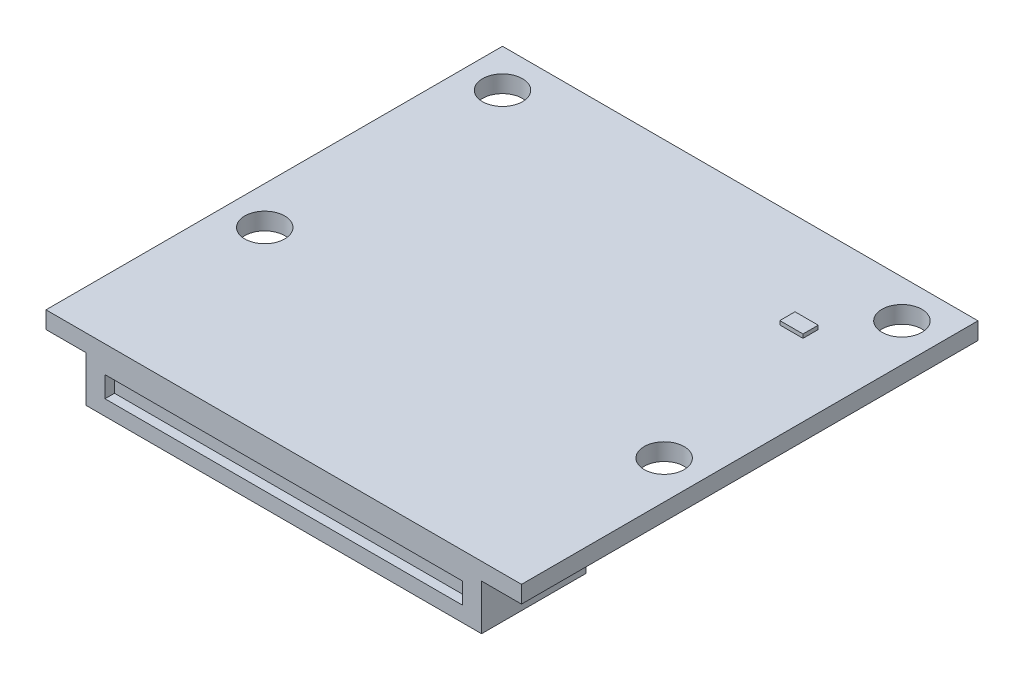
ISO-10303-21;
HEADER;
FILE_DESCRIPTION(('STEP AP214'),'2;1');
FILE_NAME('part.step','',(''),(''),'','','');
FILE_SCHEMA(('AUTOMOTIVE_DESIGN { 1 0 10303 214 1 1 1 1 }'));
ENDSEC;
DATA;
#1=APPLICATION_CONTEXT('core data for automotive mechanical design processes');
#2=APPLICATION_PROTOCOL_DEFINITION('international standard','automotive_design',2000,#1);
#3=PRODUCT_CONTEXT('',#1,'mechanical');
#4=PRODUCT('Part','Part','',(#3));
#5=PRODUCT_RELATED_PRODUCT_CATEGORY('part','',(#4));
#6=PRODUCT_DEFINITION_FORMATION('','',#4);
#7=PRODUCT_DEFINITION_CONTEXT('part definition',#1,'design');
#8=PRODUCT_DEFINITION('design','',#6,#7);
#9=PRODUCT_DEFINITION_SHAPE('','',#8);
#10=(LENGTH_UNIT() NAMED_UNIT(*) SI_UNIT(.MILLI.,.METRE.));
#11=(NAMED_UNIT(*) PLANE_ANGLE_UNIT() SI_UNIT($,.RADIAN.));
#12=(NAMED_UNIT(*) SI_UNIT($,.STERADIAN.) SOLID_ANGLE_UNIT());
#13=UNCERTAINTY_MEASURE_WITH_UNIT(LENGTH_MEASURE(1.E-05),#10,'distance_accuracy_value','');
#14=(GEOMETRIC_REPRESENTATION_CONTEXT(3) GLOBAL_UNCERTAINTY_ASSIGNED_CONTEXT((#13)) GLOBAL_UNIT_ASSIGNED_CONTEXT((#10,
#11,#12)) REPRESENTATION_CONTEXT('',''));
#15=CARTESIAN_POINT('',(0.,0.,0.));
#16=DIRECTION('',(0.,0.,1.));
#17=DIRECTION('',(1.,0.,0.));
#18=AXIS2_PLACEMENT_3D('',#15,#16,#17);
#19=CARTESIAN_POINT('',(0.,0.,0.));
#20=DIRECTION('',(0.,1.,0.));
#21=DIRECTION('',(0.,0.,1.));
#22=AXIS2_PLACEMENT_3D('',#19,#20,#21);
#23=PLANE('',#22);
#24=DIRECTION('',(0.,0.,1.));
#25=VECTOR('',#24,1.);
#26=CARTESIAN_POINT('',(-12.5,0.,-14.5));
#27=LINE('',#26,#25);
#28=CARTESIAN_POINT('',(-12.5,0.,-14.5));
#29=VERTEX_POINT('',#28);
#30=CARTESIAN_POINT('',(-12.5,0.,9.5));
#31=VERTEX_POINT('',#30);
#32=EDGE_CURVE('E274',#29,#31,#27,.T.);
#33=ORIENTED_EDGE('',*,*,#32,.T.);
#34=DIRECTION('',(1.,0.,0.));
#35=VECTOR('',#34,1.);
#36=CARTESIAN_POINT('',(-12.5,0.,9.5));
#37=LINE('',#36,#35);
#38=CARTESIAN_POINT('',(12.5,0.,9.5));
#39=VERTEX_POINT('',#38);
#40=EDGE_CURVE('E277',#31,#39,#37,.T.);
#41=ORIENTED_EDGE('',*,*,#40,.T.);
#42=DIRECTION('',(0.,0.,-1.));
#43=VECTOR('',#42,1.);
#44=CARTESIAN_POINT('',(12.5,0.,-14.5));
#45=LINE('',#44,#43);
#46=CARTESIAN_POINT('',(12.5,0.,-14.5));
#47=VERTEX_POINT('',#46);
#48=EDGE_CURVE('E281',#39,#47,#45,.T.);
#49=ORIENTED_EDGE('',*,*,#48,.T.);
#50=DIRECTION('',(-1.,0.,0.));
#51=VECTOR('',#50,1.);
#52=CARTESIAN_POINT('',(-12.5,0.,-14.5));
#53=LINE('',#52,#51);
#54=EDGE_CURVE('E284',#47,#29,#53,.T.);
#55=ORIENTED_EDGE('',*,*,#54,.T.);
#56=EDGE_LOOP('',(#33,#41,#49,#55));
#57=FACE_BOUND('',#56,.T.);
#58=CARTESIAN_POINT('',(10.5,0.,-12.5));
#59=DIRECTION('',(0.,1.,0.));
#60=DIRECTION('',(0.,0.,1.));
#61=AXIS2_PLACEMENT_3D('',#58,#59,#60);
#62=CIRCLE('',#61,1.05);
#63=CARTESIAN_POINT('',(10.5,0.,-11.45));
#64=VERTEX_POINT('',#63);
#65=EDGE_CURVE('E336',#64,#64,#62,.T.);
#66=ORIENTED_EDGE('',*,*,#65,.F.);
#67=EDGE_LOOP('',(#66));
#68=FACE_BOUND('',#67,.T.);
#69=CARTESIAN_POINT('',(10.5,0.,0.));
#70=DIRECTION('',(0.,1.,0.));
#71=DIRECTION('',(0.,0.,1.));
#72=AXIS2_PLACEMENT_3D('',#69,#70,#71);
#73=CIRCLE('',#72,1.05);
#74=CARTESIAN_POINT('',(10.5,0.,1.05));
#75=VERTEX_POINT('',#74);
#76=EDGE_CURVE('E330',#75,#75,#73,.T.);
#77=ORIENTED_EDGE('',*,*,#76,.F.);
#78=EDGE_LOOP('',(#77));
#79=FACE_BOUND('',#78,.T.);
#80=CARTESIAN_POINT('',(-10.5,0.,0.));
#81=DIRECTION('',(0.,1.,0.));
#82=DIRECTION('',(0.,0.,-1.));
#83=AXIS2_PLACEMENT_3D('',#80,#81,#82);
#84=CIRCLE('',#83,1.05);
#85=CARTESIAN_POINT('',(-10.5,0.,-1.05));
#86=VERTEX_POINT('',#85);
#87=EDGE_CURVE('E325',#86,#86,#84,.T.);
#88=ORIENTED_EDGE('',*,*,#87,.F.);
#89=EDGE_LOOP('',(#88));
#90=FACE_BOUND('',#89,.T.);
#91=CARTESIAN_POINT('',(-10.5,0.,-12.5));
#92=DIRECTION('',(0.,1.,0.));
#93=DIRECTION('',(0.,0.,-1.));
#94=AXIS2_PLACEMENT_3D('',#91,#92,#93);
#95=CIRCLE('',#94,1.05);
#96=CARTESIAN_POINT('',(-10.5,0.,-13.55));
#97=VERTEX_POINT('',#96);
#98=EDGE_CURVE('E319',#97,#97,#95,.T.);
#99=ORIENTED_EDGE('',*,*,#98,.F.);
#100=EDGE_LOOP('',(#99));
#101=FACE_BOUND('',#100,.T.);
#102=DIRECTION('',(-1.,0.,0.));
#103=VECTOR('',#102,1.);
#104=CARTESIAN_POINT('',(8.7,0.,-9.9));
#105=LINE('',#104,#103);
#106=CARTESIAN_POINT('',(8.7,0.,-9.9));
#107=VERTEX_POINT('',#106);
#108=CARTESIAN_POINT('',(7.48,0.,-9.9));
#109=VERTEX_POINT('',#108);
#110=EDGE_CURVE('E203',#107,#109,#105,.T.);
#111=ORIENTED_EDGE('',*,*,#110,.F.);
#112=DIRECTION('',(0.,0.,-1.));
#113=VECTOR('',#112,1.);
#114=CARTESIAN_POINT('',(8.7,0.,-9.1));
#115=LINE('',#114,#113);
#116=CARTESIAN_POINT('',(8.7,0.,-9.1));
#117=VERTEX_POINT('',#116);
#118=EDGE_CURVE('E186',#117,#107,#115,.T.);
#119=ORIENTED_EDGE('',*,*,#118,.F.);
#120=DIRECTION('',(1.,0.,0.));
#121=VECTOR('',#120,1.);
#122=CARTESIAN_POINT('',(8.7,0.,-9.1));
#123=LINE('',#122,#121);
#124=CARTESIAN_POINT('',(7.48,0.,-9.1));
#125=VERTEX_POINT('',#124);
#126=EDGE_CURVE('E194',#125,#117,#123,.T.);
#127=ORIENTED_EDGE('',*,*,#126,.F.);
#128=DIRECTION('',(0.,0.,1.));
#129=VECTOR('',#128,1.);
#130=CARTESIAN_POINT('',(7.48,0.,-9.1));
#131=LINE('',#130,#129);
#132=EDGE_CURVE('E205',#109,#125,#131,.T.);
#133=ORIENTED_EDGE('',*,*,#132,.F.);
#134=EDGE_LOOP('',(#111,#119,#127,#133));
#135=FACE_BOUND('',#134,.T.);
#136=ADVANCED_FACE('F36',(#57,#68,#79,#90,#101,#135),#23,.T.);
#137=CARTESIAN_POINT('',(0.,-0.9,0.));
#138=DIRECTION('',(0.,1.,0.));
#139=DIRECTION('',(0.,0.,1.));
#140=AXIS2_PLACEMENT_3D('',#137,#138,#139);
#141=PLANE('',#140);
#142=CARTESIAN_POINT('',(10.5,-0.9,-12.5));
#143=DIRECTION('',(0.,1.,0.));
#144=DIRECTION('',(0.,0.,1.));
#145=AXIS2_PLACEMENT_3D('',#142,#143,#144);
#146=CIRCLE('',#145,1.05);
#147=CARTESIAN_POINT('',(10.5,-0.9,-11.45));
#148=VERTEX_POINT('',#147);
#149=EDGE_CURVE('E278',#148,#148,#146,.T.);
#150=ORIENTED_EDGE('',*,*,#149,.T.);
#151=EDGE_LOOP('',(#150));
#152=FACE_BOUND('',#151,.T.);
#153=CARTESIAN_POINT('',(10.5,-0.9,0.));
#154=DIRECTION('',(0.,1.,0.));
#155=DIRECTION('',(0.,0.,1.));
#156=AXIS2_PLACEMENT_3D('',#153,#154,#155);
#157=CIRCLE('',#156,1.05);
#158=CARTESIAN_POINT('',(10.5,-0.9,1.05));
#159=VERTEX_POINT('',#158);
#160=EDGE_CURVE('E333',#159,#159,#157,.T.);
#161=ORIENTED_EDGE('',*,*,#160,.T.);
#162=EDGE_LOOP('',(#161));
#163=FACE_BOUND('',#162,.T.);
#164=CARTESIAN_POINT('',(-10.5,-0.9,0.));
#165=DIRECTION('',(0.,1.,0.));
#166=DIRECTION('',(0.,0.,-1.));
#167=AXIS2_PLACEMENT_3D('',#164,#165,#166);
#168=CIRCLE('',#167,1.05);
#169=CARTESIAN_POINT('',(-10.5,-0.9,-1.05));
#170=VERTEX_POINT('',#169);
#171=EDGE_CURVE('E327',#170,#170,#168,.T.);
#172=ORIENTED_EDGE('',*,*,#171,.T.);
#173=EDGE_LOOP('',(#172));
#174=FACE_BOUND('',#173,.T.);
#175=CARTESIAN_POINT('',(-10.5,-0.9,-12.5));
#176=DIRECTION('',(0.,1.,0.));
#177=DIRECTION('',(0.,0.,-1.));
#178=AXIS2_PLACEMENT_3D('',#175,#176,#177);
#179=CIRCLE('',#178,1.05);
#180=CARTESIAN_POINT('',(-10.5,-0.9,-13.55));
#181=VERTEX_POINT('',#180);
#182=EDGE_CURVE('E321',#181,#181,#179,.T.);
#183=ORIENTED_EDGE('',*,*,#182,.T.);
#184=EDGE_LOOP('',(#183));
#185=FACE_BOUND('',#184,.T.);
#186=DIRECTION('',(0.,0.,-1.));
#187=VECTOR('',#186,1.);
#188=CARTESIAN_POINT('',(-10.4,-0.9,9.5));
#189=LINE('',#188,#187);
#190=CARTESIAN_POINT('',(-10.4,-0.9,9.5));
#191=VERTEX_POINT('',#190);
#192=CARTESIAN_POINT('',(-10.4,-0.9,4.));
#193=VERTEX_POINT('',#192);
#194=EDGE_CURVE('E216',#191,#193,#189,.T.);
#195=ORIENTED_EDGE('',*,*,#194,.F.);
#196=DIRECTION('',(1.,0.,0.));
#197=VECTOR('',#196,1.);
#198=CARTESIAN_POINT('',(-12.5,-0.9,9.5));
#199=LINE('',#198,#197);
#200=CARTESIAN_POINT('',(-12.5,-0.9,9.5));
#201=VERTEX_POINT('',#200);
#202=EDGE_CURVE('E259',#201,#191,#199,.T.);
#203=ORIENTED_EDGE('',*,*,#202,.F.);
#204=DIRECTION('',(0.,0.,1.));
#205=VECTOR('',#204,1.);
#206=CARTESIAN_POINT('',(-12.5,-0.9,-14.5));
#207=LINE('',#206,#205);
#208=CARTESIAN_POINT('',(-12.5,-0.9,-14.5));
#209=VERTEX_POINT('',#208);
#210=EDGE_CURVE('E260',#209,#201,#207,.T.);
#211=ORIENTED_EDGE('',*,*,#210,.F.);
#212=DIRECTION('',(-1.,0.,0.));
#213=VECTOR('',#212,1.);
#214=CARTESIAN_POINT('',(-12.5,-0.9,-14.5));
#215=LINE('',#214,#213);
#216=CARTESIAN_POINT('',(12.5,-0.9,-14.5));
#217=VERTEX_POINT('',#216);
#218=EDGE_CURVE('E270',#217,#209,#215,.T.);
#219=ORIENTED_EDGE('',*,*,#218,.F.);
#220=DIRECTION('',(0.,0.,-1.));
#221=VECTOR('',#220,1.);
#222=CARTESIAN_POINT('',(12.5,-0.9,-14.5));
#223=LINE('',#222,#221);
#224=CARTESIAN_POINT('',(12.5,-0.9,9.5));
#225=VERTEX_POINT('',#224);
#226=EDGE_CURVE('E266',#225,#217,#223,.T.);
#227=ORIENTED_EDGE('',*,*,#226,.F.);
#228=CARTESIAN_POINT('',(10.4,-0.9,9.5));
#229=VERTEX_POINT('',#228);
#230=EDGE_CURVE('E256',#229,#225,#199,.T.);
#231=ORIENTED_EDGE('',*,*,#230,.F.);
#232=DIRECTION('',(0.,0.,1.));
#233=VECTOR('',#232,1.);
#234=CARTESIAN_POINT('',(10.4,-0.9,9.5));
#235=LINE('',#234,#233);
#236=CARTESIAN_POINT('',(10.4,-0.9,4.));
#237=VERTEX_POINT('',#236);
#238=EDGE_CURVE('E221',#237,#229,#235,.T.);
#239=ORIENTED_EDGE('',*,*,#238,.F.);
#240=DIRECTION('',(1.,0.,0.));
#241=VECTOR('',#240,1.);
#242=CARTESIAN_POINT('',(-10.4,-0.9,4.));
#243=LINE('',#242,#241);
#244=EDGE_CURVE('E228',#193,#237,#243,.T.);
#245=ORIENTED_EDGE('',*,*,#244,.F.);
#246=EDGE_LOOP('',(#195,#203,#211,#219,#227,#231,#239,#245));
#247=FACE_BOUND('',#246,.T.);
#248=ADVANCED_FACE('F306',(#152,#163,#174,#185,#247),#141,.F.);
#249=CARTESIAN_POINT('',(-12.5,-0.9,-14.5));
#250=DIRECTION('',(-1.,0.,0.));
#251=DIRECTION('',(0.,0.,1.));
#252=AXIS2_PLACEMENT_3D('',#249,#250,#251);
#253=PLANE('',#252);
#254=ORIENTED_EDGE('',*,*,#32,.F.);
#255=DIRECTION('',(0.,1.,0.));
#256=VECTOR('',#255,1.);
#257=CARTESIAN_POINT('',(-12.5,-0.9,-14.5));
#258=LINE('',#257,#256);
#259=EDGE_CURVE('E11',#209,#29,#258,.T.);
#260=ORIENTED_EDGE('',*,*,#259,.F.);
#261=ORIENTED_EDGE('',*,*,#210,.T.);
#262=DIRECTION('',(0.,1.,0.));
#263=VECTOR('',#262,1.);
#264=CARTESIAN_POINT('',(-12.5,-0.9,9.5));
#265=LINE('',#264,#263);
#266=EDGE_CURVE('E273',#201,#31,#265,.T.);
#267=ORIENTED_EDGE('',*,*,#266,.T.);
#268=EDGE_LOOP('',(#254,#260,#261,#267));
#269=FACE_BOUND('',#268,.T.);
#270=ADVANCED_FACE('F38',(#269),#253,.T.);
#271=CARTESIAN_POINT('',(-12.5,-0.9,-14.5));
#272=DIRECTION('',(0.,0.,-1.));
#273=DIRECTION('',(-1.,0.,0.));
#274=AXIS2_PLACEMENT_3D('',#271,#272,#273);
#275=PLANE('',#274);
#276=ORIENTED_EDGE('',*,*,#54,.F.);
#277=DIRECTION('',(0.,1.,0.));
#278=VECTOR('',#277,1.);
#279=CARTESIAN_POINT('',(12.5,-0.9,-14.5));
#280=LINE('',#279,#278);
#281=EDGE_CURVE('E45',#217,#47,#280,.T.);
#282=ORIENTED_EDGE('',*,*,#281,.F.);
#283=ORIENTED_EDGE('',*,*,#218,.T.);
#284=ORIENTED_EDGE('',*,*,#259,.T.);
#285=EDGE_LOOP('',(#276,#282,#283,#284));
#286=FACE_BOUND('',#285,.T.);
#287=ADVANCED_FACE('F303',(#286),#275,.T.);
#288=CARTESIAN_POINT('',(12.5,-0.9,-14.5));
#289=DIRECTION('',(1.,0.,0.));
#290=DIRECTION('',(0.,0.,-1.));
#291=AXIS2_PLACEMENT_3D('',#288,#289,#290);
#292=PLANE('',#291);
#293=ORIENTED_EDGE('',*,*,#48,.F.);
#294=DIRECTION('',(0.,1.,0.));
#295=VECTOR('',#294,1.);
#296=CARTESIAN_POINT('',(12.5,-0.9,9.5));
#297=LINE('',#296,#295);
#298=EDGE_CURVE('E288',#225,#39,#297,.T.);
#299=ORIENTED_EDGE('',*,*,#298,.F.);
#300=ORIENTED_EDGE('',*,*,#226,.T.);
#301=ORIENTED_EDGE('',*,*,#281,.T.);
#302=EDGE_LOOP('',(#293,#299,#300,#301));
#303=FACE_BOUND('',#302,.T.);
#304=ADVANCED_FACE('F413',(#303),#292,.T.);
#305=CARTESIAN_POINT('',(-12.5,-0.9,9.5));
#306=DIRECTION('',(0.,0.,1.));
#307=DIRECTION('',(1.,0.,0.));
#308=AXIS2_PLACEMENT_3D('',#305,#306,#307);
#309=PLANE('',#308);
#310=DIRECTION('',(0.,-1.,0.));
#311=VECTOR('',#310,1.);
#312=CARTESIAN_POINT('',(-9.4,-1.4,9.5));
#313=LINE('',#312,#311);
#314=CARTESIAN_POINT('',(-9.4,-1.4,9.5));
#315=VERTEX_POINT('',#314);
#316=CARTESIAN_POINT('',(-9.4,-2.5,9.5));
#317=VERTEX_POINT('',#316);
#318=EDGE_CURVE('E53',#315,#317,#313,.T.);
#319=ORIENTED_EDGE('',*,*,#318,.F.);
#320=DIRECTION('',(-1.,0.,0.));
#321=VECTOR('',#320,1.);
#322=CARTESIAN_POINT('',(-9.4,-1.4,9.5));
#323=LINE('',#322,#321);
#324=CARTESIAN_POINT('',(9.4,-1.4,9.5));
#325=VERTEX_POINT('',#324);
#326=EDGE_CURVE('E171',#325,#315,#323,.T.);
#327=ORIENTED_EDGE('',*,*,#326,.F.);
#328=DIRECTION('',(0.,1.,0.));
#329=VECTOR('',#328,1.);
#330=CARTESIAN_POINT('',(9.4,-1.4,9.5));
#331=LINE('',#330,#329);
#332=CARTESIAN_POINT('',(9.4,-2.5,9.5));
#333=VERTEX_POINT('',#332);
#334=EDGE_CURVE('E174',#333,#325,#331,.T.);
#335=ORIENTED_EDGE('',*,*,#334,.F.);
#336=DIRECTION('',(1.,0.,0.));
#337=VECTOR('',#336,1.);
#338=CARTESIAN_POINT('',(-9.4,-2.5,9.5));
#339=LINE('',#338,#337);
#340=EDGE_CURVE('E180',#317,#333,#339,.T.);
#341=ORIENTED_EDGE('',*,*,#340,.F.);
#342=EDGE_LOOP('',(#319,#327,#335,#341));
#343=FACE_BOUND('',#342,.T.);
#344=ORIENTED_EDGE('',*,*,#40,.F.);
#345=ORIENTED_EDGE('',*,*,#266,.F.);
#346=ORIENTED_EDGE('',*,*,#202,.T.);
#347=DIRECTION('',(0.,1.,0.));
#348=VECTOR('',#347,1.);
#349=CARTESIAN_POINT('',(-10.4,-3.3,9.5));
#350=LINE('',#349,#348);
#351=CARTESIAN_POINT('',(-10.4,-3.3,9.5));
#352=VERTEX_POINT('',#351);
#353=EDGE_CURVE('E227',#352,#191,#350,.T.);
#354=ORIENTED_EDGE('',*,*,#353,.F.);
#355=DIRECTION('',(-1.,0.,0.));
#356=VECTOR('',#355,1.);
#357=CARTESIAN_POINT('',(-10.4,-3.3,9.5));
#358=LINE('',#357,#356);
#359=CARTESIAN_POINT('',(10.4,-3.3,9.5));
#360=VERTEX_POINT('',#359);
#361=EDGE_CURVE('E225',#360,#352,#358,.T.);
#362=ORIENTED_EDGE('',*,*,#361,.F.);
#363=DIRECTION('',(0.,1.,0.));
#364=VECTOR('',#363,1.);
#365=CARTESIAN_POINT('',(10.4,-3.3,9.5));
#366=LINE('',#365,#364);
#367=EDGE_CURVE('E240',#360,#229,#366,.T.);
#368=ORIENTED_EDGE('',*,*,#367,.T.);
#369=ORIENTED_EDGE('',*,*,#230,.T.);
#370=ORIENTED_EDGE('',*,*,#298,.T.);
#371=EDGE_LOOP('',(#344,#345,#346,#354,#362,#368,#369,#370));
#372=FACE_BOUND('',#371,.T.);
#373=ADVANCED_FACE('F296',(#343,#372),#309,.T.);
#374=CARTESIAN_POINT('',(10.5,-0.9,-12.5));
#375=DIRECTION('',(0.,1.,0.));
#376=DIRECTION('',(0.,0.,1.));
#377=AXIS2_PLACEMENT_3D('',#374,#375,#376);
#378=CYLINDRICAL_SURFACE('',#377,1.05);
#379=ORIENTED_EDGE('',*,*,#149,.F.);
#380=EDGE_LOOP('',(#379));
#381=FACE_BOUND('',#380,.T.);
#382=ORIENTED_EDGE('',*,*,#65,.T.);
#383=EDGE_LOOP('',(#382));
#384=FACE_BOUND('',#383,.T.);
#385=ADVANCED_FACE('F343',(#381,#384),#378,.F.);
#386=CARTESIAN_POINT('',(10.5,-0.9,0.));
#387=DIRECTION('',(0.,1.,0.));
#388=DIRECTION('',(0.,0.,1.));
#389=AXIS2_PLACEMENT_3D('',#386,#387,#388);
#390=CYLINDRICAL_SURFACE('',#389,1.05);
#391=ORIENTED_EDGE('',*,*,#160,.F.);
#392=EDGE_LOOP('',(#391));
#393=FACE_BOUND('',#392,.T.);
#394=ORIENTED_EDGE('',*,*,#76,.T.);
#395=EDGE_LOOP('',(#394));
#396=FACE_BOUND('',#395,.T.);
#397=ADVANCED_FACE('F400',(#393,#396),#390,.F.);
#398=CARTESIAN_POINT('',(-10.5,-0.9,0.));
#399=DIRECTION('',(0.,1.,0.));
#400=DIRECTION('',(0.,0.,1.));
#401=AXIS2_PLACEMENT_3D('',#398,#399,#400);
#402=CYLINDRICAL_SURFACE('',#401,1.05);
#403=ORIENTED_EDGE('',*,*,#171,.F.);
#404=EDGE_LOOP('',(#403));
#405=FACE_BOUND('',#404,.T.);
#406=ORIENTED_EDGE('',*,*,#87,.T.);
#407=EDGE_LOOP('',(#406));
#408=FACE_BOUND('',#407,.T.);
#409=ADVANCED_FACE('F396',(#405,#408),#402,.F.);
#410=CARTESIAN_POINT('',(-10.5,-0.9,-12.5));
#411=DIRECTION('',(0.,1.,0.));
#412=DIRECTION('',(0.,0.,1.));
#413=AXIS2_PLACEMENT_3D('',#410,#411,#412);
#414=CYLINDRICAL_SURFACE('',#413,1.05);
#415=ORIENTED_EDGE('',*,*,#182,.F.);
#416=EDGE_LOOP('',(#415));
#417=FACE_BOUND('',#416,.T.);
#418=ORIENTED_EDGE('',*,*,#98,.T.);
#419=EDGE_LOOP('',(#418));
#420=FACE_BOUND('',#419,.T.);
#421=ADVANCED_FACE('F393',(#417,#420),#414,.F.);
#422=CARTESIAN_POINT('',(-10.4,-3.3,9.5));
#423=DIRECTION('',(1.,0.,0.));
#424=DIRECTION('',(0.,0.,-1.));
#425=AXIS2_PLACEMENT_3D('',#422,#423,#424);
#426=PLANE('',#425);
#427=ORIENTED_EDGE('',*,*,#194,.T.);
#428=DIRECTION('',(0.,1.,0.));
#429=VECTOR('',#428,1.);
#430=CARTESIAN_POINT('',(-10.4,-3.3,4.));
#431=LINE('',#430,#429);
#432=CARTESIAN_POINT('',(-10.4,-3.3,4.));
#433=VERTEX_POINT('',#432);
#434=EDGE_CURVE('E246',#433,#193,#431,.T.);
#435=ORIENTED_EDGE('',*,*,#434,.F.);
#436=DIRECTION('',(0.,0.,-1.));
#437=VECTOR('',#436,1.);
#438=CARTESIAN_POINT('',(-10.4,-3.3,9.5));
#439=LINE('',#438,#437);
#440=EDGE_CURVE('E217',#352,#433,#439,.T.);
#441=ORIENTED_EDGE('',*,*,#440,.F.);
#442=ORIENTED_EDGE('',*,*,#353,.T.);
#443=EDGE_LOOP('',(#427,#435,#441,#442));
#444=FACE_BOUND('',#443,.T.);
#445=ADVANCED_FACE('F309',(#444),#426,.F.);
#446=CARTESIAN_POINT('',(-10.4,-3.3,4.));
#447=DIRECTION('',(0.,0.,1.));
#448=DIRECTION('',(1.,0.,0.));
#449=AXIS2_PLACEMENT_3D('',#446,#447,#448);
#450=PLANE('',#449);
#451=ORIENTED_EDGE('',*,*,#244,.T.);
#452=DIRECTION('',(0.,1.,0.));
#453=VECTOR('',#452,1.);
#454=CARTESIAN_POINT('',(10.4,-3.3,4.));
#455=LINE('',#454,#453);
#456=CARTESIAN_POINT('',(10.4,-3.3,4.));
#457=VERTEX_POINT('',#456);
#458=EDGE_CURVE('E233',#457,#237,#455,.T.);
#459=ORIENTED_EDGE('',*,*,#458,.F.);
#460=DIRECTION('',(1.,0.,0.));
#461=VECTOR('',#460,1.);
#462=CARTESIAN_POINT('',(-10.4,-3.3,4.));
#463=LINE('',#462,#461);
#464=EDGE_CURVE('E220',#433,#457,#463,.T.);
#465=ORIENTED_EDGE('',*,*,#464,.F.);
#466=ORIENTED_EDGE('',*,*,#434,.T.);
#467=EDGE_LOOP('',(#451,#459,#465,#466));
#468=FACE_BOUND('',#467,.T.);
#469=ADVANCED_FACE('F318',(#468),#450,.F.);
#470=CARTESIAN_POINT('',(10.4,-3.3,9.5));
#471=DIRECTION('',(-1.,0.,0.));
#472=DIRECTION('',(0.,0.,1.));
#473=AXIS2_PLACEMENT_3D('',#470,#471,#472);
#474=PLANE('',#473);
#475=ORIENTED_EDGE('',*,*,#238,.T.);
#476=ORIENTED_EDGE('',*,*,#367,.F.);
#477=DIRECTION('',(0.,0.,1.));
#478=VECTOR('',#477,1.);
#479=CARTESIAN_POINT('',(10.4,-3.3,9.5));
#480=LINE('',#479,#478);
#481=EDGE_CURVE('E223',#457,#360,#480,.T.);
#482=ORIENTED_EDGE('',*,*,#481,.F.);
#483=ORIENTED_EDGE('',*,*,#458,.T.);
#484=EDGE_LOOP('',(#475,#476,#482,#483));
#485=FACE_BOUND('',#484,.T.);
#486=ADVANCED_FACE('F316',(#485),#474,.F.);
#487=CARTESIAN_POINT('',(0.,-3.3,0.));
#488=DIRECTION('',(0.,-1.,0.));
#489=DIRECTION('',(0.,0.,-1.));
#490=AXIS2_PLACEMENT_3D('',#487,#488,#489);
#491=PLANE('',#490);
#492=ORIENTED_EDGE('',*,*,#440,.T.);
#493=ORIENTED_EDGE('',*,*,#464,.T.);
#494=ORIENTED_EDGE('',*,*,#481,.T.);
#495=ORIENTED_EDGE('',*,*,#361,.T.);
#496=EDGE_LOOP('',(#492,#493,#494,#495));
#497=FACE_BOUND('',#496,.T.);
#498=ADVANCED_FACE('F312',(#497),#491,.T.);
#499=CARTESIAN_POINT('',(8.7,0.2,-9.1));
#500=DIRECTION('',(-1.,0.,0.));
#501=DIRECTION('',(0.,0.,1.));
#502=AXIS2_PLACEMENT_3D('',#499,#500,#501);
#503=PLANE('',#502);
#504=ORIENTED_EDGE('',*,*,#118,.T.);
#505=DIRECTION('',(0.,-1.,0.));
#506=VECTOR('',#505,1.);
#507=CARTESIAN_POINT('',(8.7,0.2,-9.9));
#508=LINE('',#507,#506);
#509=CARTESIAN_POINT('',(8.7,0.2,-9.9));
#510=VERTEX_POINT('',#509);
#511=EDGE_CURVE('E214',#510,#107,#508,.T.);
#512=ORIENTED_EDGE('',*,*,#511,.F.);
#513=DIRECTION('',(0.,0.,-1.));
#514=VECTOR('',#513,1.);
#515=CARTESIAN_POINT('',(8.7,0.2,-9.1));
#516=LINE('',#515,#514);
#517=CARTESIAN_POINT('',(8.7,0.2,-9.1));
#518=VERTEX_POINT('',#517);
#519=EDGE_CURVE('E190',#518,#510,#516,.T.);
#520=ORIENTED_EDGE('',*,*,#519,.F.);
#521=DIRECTION('',(0.,-1.,0.));
#522=VECTOR('',#521,1.);
#523=CARTESIAN_POINT('',(8.7,0.2,-9.1));
#524=LINE('',#523,#522);
#525=EDGE_CURVE('E200',#518,#117,#524,.T.);
#526=ORIENTED_EDGE('',*,*,#525,.T.);
#527=EDGE_LOOP('',(#504,#512,#520,#526));
#528=FACE_BOUND('',#527,.T.);
#529=ADVANCED_FACE('F369',(#528),#503,.F.);
#530=CARTESIAN_POINT('',(8.7,0.2,-9.9));
#531=DIRECTION('',(0.,0.,1.));
#532=DIRECTION('',(1.,0.,0.));
#533=AXIS2_PLACEMENT_3D('',#530,#531,#532);
#534=PLANE('',#533);
#535=ORIENTED_EDGE('',*,*,#110,.T.);
#536=DIRECTION('',(0.,-1.,0.));
#537=VECTOR('',#536,1.);
#538=CARTESIAN_POINT('',(7.48,0.2,-9.9));
#539=LINE('',#538,#537);
#540=CARTESIAN_POINT('',(7.48,0.2,-9.9));
#541=VERTEX_POINT('',#540);
#542=EDGE_CURVE('E211',#541,#109,#539,.T.);
#543=ORIENTED_EDGE('',*,*,#542,.F.);
#544=DIRECTION('',(-1.,0.,0.));
#545=VECTOR('',#544,1.);
#546=CARTESIAN_POINT('',(8.7,0.2,-9.9));
#547=LINE('',#546,#545);
#548=EDGE_CURVE('E193',#510,#541,#547,.T.);
#549=ORIENTED_EDGE('',*,*,#548,.F.);
#550=ORIENTED_EDGE('',*,*,#511,.T.);
#551=EDGE_LOOP('',(#535,#543,#549,#550));
#552=FACE_BOUND('',#551,.T.);
#553=ADVANCED_FACE('F359',(#552),#534,.F.);
#554=CARTESIAN_POINT('',(7.48,0.2,-9.1));
#555=DIRECTION('',(1.,0.,0.));
#556=DIRECTION('',(0.,0.,-1.));
#557=AXIS2_PLACEMENT_3D('',#554,#555,#556);
#558=PLANE('',#557);
#559=ORIENTED_EDGE('',*,*,#132,.T.);
#560=DIRECTION('',(0.,-1.,0.));
#561=VECTOR('',#560,1.);
#562=CARTESIAN_POINT('',(7.48,0.2,-9.1));
#563=LINE('',#562,#561);
#564=CARTESIAN_POINT('',(7.48,0.2,-9.1));
#565=VERTEX_POINT('',#564);
#566=EDGE_CURVE('E61',#565,#125,#563,.T.);
#567=ORIENTED_EDGE('',*,*,#566,.F.);
#568=DIRECTION('',(0.,0.,1.));
#569=VECTOR('',#568,1.);
#570=CARTESIAN_POINT('',(7.48,0.2,-9.1));
#571=LINE('',#570,#569);
#572=EDGE_CURVE('E196',#541,#565,#571,.T.);
#573=ORIENTED_EDGE('',*,*,#572,.F.);
#574=ORIENTED_EDGE('',*,*,#542,.T.);
#575=EDGE_LOOP('',(#559,#567,#573,#574));
#576=FACE_BOUND('',#575,.T.);
#577=ADVANCED_FACE('F363',(#576),#558,.F.);
#578=CARTESIAN_POINT('',(8.7,0.2,-9.1));
#579=DIRECTION('',(0.,0.,-1.));
#580=DIRECTION('',(-1.,0.,0.));
#581=AXIS2_PLACEMENT_3D('',#578,#579,#580);
#582=PLANE('',#581);
#583=ORIENTED_EDGE('',*,*,#126,.T.);
#584=ORIENTED_EDGE('',*,*,#525,.F.);
#585=DIRECTION('',(1.,0.,0.));
#586=VECTOR('',#585,1.);
#587=CARTESIAN_POINT('',(8.7,0.2,-9.1));
#588=LINE('',#587,#586);
#589=EDGE_CURVE('E198',#565,#518,#588,.T.);
#590=ORIENTED_EDGE('',*,*,#589,.F.);
#591=ORIENTED_EDGE('',*,*,#566,.T.);
#592=EDGE_LOOP('',(#583,#584,#590,#591));
#593=FACE_BOUND('',#592,.T.);
#594=ADVANCED_FACE('F370',(#593),#582,.F.);
#595=CARTESIAN_POINT('',(0.,0.2,0.));
#596=DIRECTION('',(0.,1.,0.));
#597=DIRECTION('',(0.,0.,1.));
#598=AXIS2_PLACEMENT_3D('',#595,#596,#597);
#599=PLANE('',#598);
#600=ORIENTED_EDGE('',*,*,#519,.T.);
#601=ORIENTED_EDGE('',*,*,#548,.T.);
#602=ORIENTED_EDGE('',*,*,#572,.T.);
#603=ORIENTED_EDGE('',*,*,#589,.T.);
#604=EDGE_LOOP('',(#600,#601,#602,#603));
#605=FACE_BOUND('',#604,.T.);
#606=ADVANCED_FACE('F365',(#605),#599,.T.);
#607=CARTESIAN_POINT('',(-9.4,-1.4,9.));
#608=DIRECTION('',(-1.,0.,0.));
#609=DIRECTION('',(0.,0.,1.));
#610=AXIS2_PLACEMENT_3D('',#607,#608,#609);
#611=PLANE('',#610);
#612=ORIENTED_EDGE('',*,*,#318,.T.);
#613=DIRECTION('',(0.,0.,1.));
#614=VECTOR('',#613,1.);
#615=CARTESIAN_POINT('',(-9.4,-2.5,9.));
#616=LINE('',#615,#614);
#617=CARTESIAN_POINT('',(-9.4,-2.5,9.));
#618=VERTEX_POINT('',#617);
#619=EDGE_CURVE('E149',#618,#317,#616,.T.);
#620=ORIENTED_EDGE('',*,*,#619,.F.);
#621=DIRECTION('',(0.,-1.,0.));
#622=VECTOR('',#621,1.);
#623=CARTESIAN_POINT('',(-9.4,-1.4,9.));
#624=LINE('',#623,#622);
#625=CARTESIAN_POINT('',(-9.4,-1.4,9.));
#626=VERTEX_POINT('',#625);
#627=EDGE_CURVE('E153',#626,#618,#624,.T.);
#628=ORIENTED_EDGE('',*,*,#627,.F.);
#629=DIRECTION('',(0.,0.,1.));
#630=VECTOR('',#629,1.);
#631=CARTESIAN_POINT('',(-9.4,-1.4,9.));
#632=LINE('',#631,#630);
#633=EDGE_CURVE('E184',#626,#315,#632,.T.);
#634=ORIENTED_EDGE('',*,*,#633,.T.);
#635=EDGE_LOOP('',(#612,#620,#628,#634));
#636=FACE_BOUND('',#635,.T.);
#637=ADVANCED_FACE('F151',(#636),#611,.F.);
#638=CARTESIAN_POINT('',(-9.4,-1.4,9.));
#639=DIRECTION('',(0.,1.,0.));
#640=DIRECTION('',(0.,0.,1.));
#641=AXIS2_PLACEMENT_3D('',#638,#639,#640);
#642=PLANE('',#641);
#643=ORIENTED_EDGE('',*,*,#326,.T.);
#644=ORIENTED_EDGE('',*,*,#633,.F.);
#645=DIRECTION('',(-1.,0.,0.));
#646=VECTOR('',#645,1.);
#647=CARTESIAN_POINT('',(-9.4,-1.4,9.));
#648=LINE('',#647,#646);
#649=CARTESIAN_POINT('',(9.4,-1.4,9.));
#650=VERTEX_POINT('',#649);
#651=EDGE_CURVE('E159',#650,#626,#648,.T.);
#652=ORIENTED_EDGE('',*,*,#651,.F.);
#653=DIRECTION('',(0.,0.,1.));
#654=VECTOR('',#653,1.);
#655=CARTESIAN_POINT('',(9.4,-1.4,9.));
#656=LINE('',#655,#654);
#657=EDGE_CURVE('E187',#650,#325,#656,.T.);
#658=ORIENTED_EDGE('',*,*,#657,.T.);
#659=EDGE_LOOP('',(#643,#644,#652,#658));
#660=FACE_BOUND('',#659,.T.);
#661=ADVANCED_FACE('F425',(#660),#642,.F.);
#662=CARTESIAN_POINT('',(9.4,-1.4,9.));
#663=DIRECTION('',(1.,0.,0.));
#664=DIRECTION('',(0.,0.,-1.));
#665=AXIS2_PLACEMENT_3D('',#662,#663,#664);
#666=PLANE('',#665);
#667=ORIENTED_EDGE('',*,*,#334,.T.);
#668=ORIENTED_EDGE('',*,*,#657,.F.);
#669=DIRECTION('',(0.,1.,0.));
#670=VECTOR('',#669,1.);
#671=CARTESIAN_POINT('',(9.4,-1.4,9.));
#672=LINE('',#671,#670);
#673=CARTESIAN_POINT('',(9.4,-2.5,9.));
#674=VERTEX_POINT('',#673);
#675=EDGE_CURVE('E167',#674,#650,#672,.T.);
#676=ORIENTED_EDGE('',*,*,#675,.F.);
#677=DIRECTION('',(0.,0.,1.));
#678=VECTOR('',#677,1.);
#679=CARTESIAN_POINT('',(9.4,-2.5,9.));
#680=LINE('',#679,#678);
#681=EDGE_CURVE('E158',#674,#333,#680,.T.);
#682=ORIENTED_EDGE('',*,*,#681,.T.);
#683=EDGE_LOOP('',(#667,#668,#676,#682));
#684=FACE_BOUND('',#683,.T.);
#685=ADVANCED_FACE('F423',(#684),#666,.F.);
#686=CARTESIAN_POINT('',(-9.4,-2.5,9.));
#687=DIRECTION('',(0.,-1.,0.));
#688=DIRECTION('',(0.,0.,-1.));
#689=AXIS2_PLACEMENT_3D('',#686,#687,#688);
#690=PLANE('',#689);
#691=ORIENTED_EDGE('',*,*,#340,.T.);
#692=ORIENTED_EDGE('',*,*,#681,.F.);
#693=DIRECTION('',(1.,0.,0.));
#694=VECTOR('',#693,1.);
#695=CARTESIAN_POINT('',(-9.4,-2.5,9.));
#696=LINE('',#695,#694);
#697=EDGE_CURVE('E162',#618,#674,#696,.T.);
#698=ORIENTED_EDGE('',*,*,#697,.F.);
#699=ORIENTED_EDGE('',*,*,#619,.T.);
#700=EDGE_LOOP('',(#691,#692,#698,#699));
#701=FACE_BOUND('',#700,.T.);
#702=ADVANCED_FACE('F163',(#701),#690,.F.);
#703=CARTESIAN_POINT('',(0.,0.,9.));
#704=DIRECTION('',(0.,0.,1.));
#705=DIRECTION('',(1.,0.,0.));
#706=AXIS2_PLACEMENT_3D('',#703,#704,#705);
#707=PLANE('',#706);
#708=ORIENTED_EDGE('',*,*,#627,.T.);
#709=ORIENTED_EDGE('',*,*,#697,.T.);
#710=ORIENTED_EDGE('',*,*,#675,.T.);
#711=ORIENTED_EDGE('',*,*,#651,.T.);
#712=EDGE_LOOP('',(#708,#709,#710,#711));
#713=FACE_BOUND('',#712,.T.);
#714=ADVANCED_FACE('F169',(#713),#707,.T.);
#715=CLOSED_SHELL('',(#136,#248,#270,#287,#304,#373,#385,#397,#409,#421,#445,#469,#486,#498,
#529,#553,#577,#594,#606,#637,#661,#685,#702,#714));
#716=MANIFOLD_SOLID_BREP('B2',#715);
#717=ADVANCED_BREP_SHAPE_REPRESENTATION('',(#18,#716),#14);
#718=SHAPE_DEFINITION_REPRESENTATION(#9,#717);
ENDSEC;
END-ISO-10303-21;
